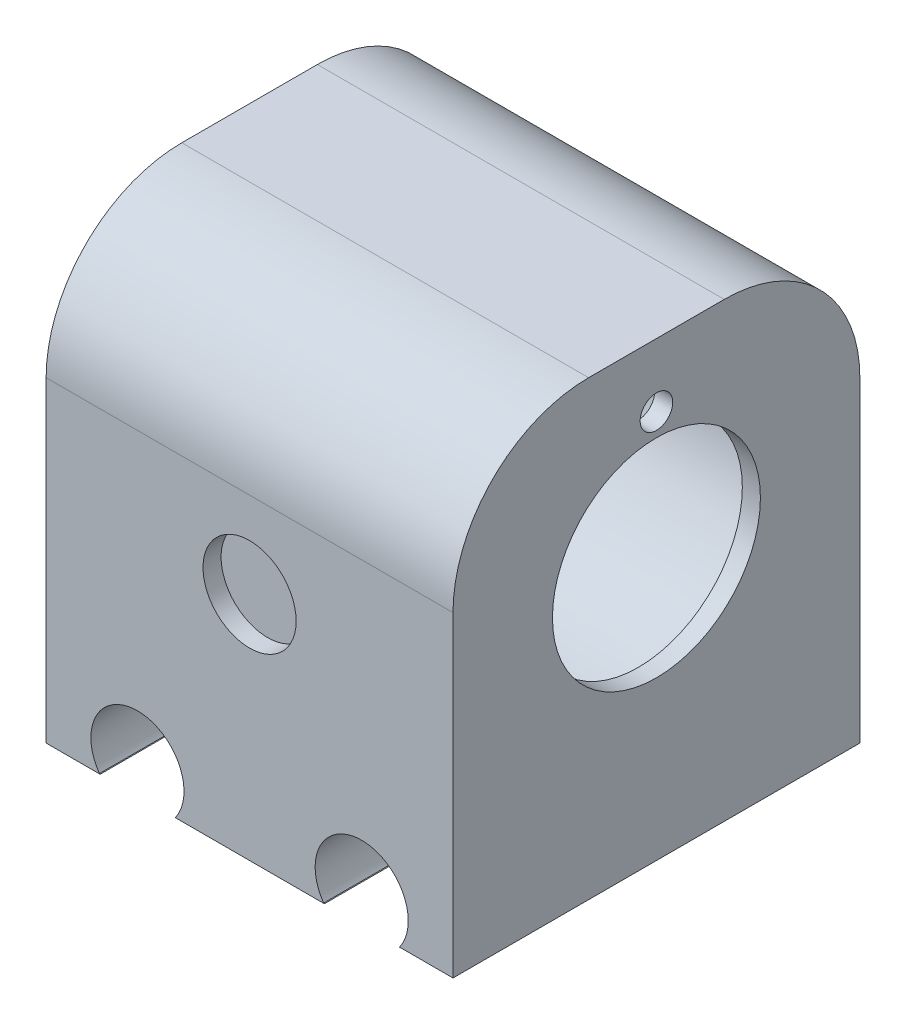
ISO-10303-21;
HEADER;
FILE_DESCRIPTION(('STEP AP214'),'2;1');
FILE_NAME('part.step','',(''),(''),'','','');
FILE_SCHEMA(('AUTOMOTIVE_DESIGN { 1 0 10303 214 1 1 1 1 }'));
ENDSEC;
DATA;
#1=APPLICATION_CONTEXT('core data for automotive mechanical design processes');
#2=APPLICATION_PROTOCOL_DEFINITION('international standard','automotive_design',2000,#1);
#3=PRODUCT_CONTEXT('',#1,'mechanical');
#4=PRODUCT('Part','Part','',(#3));
#5=PRODUCT_RELATED_PRODUCT_CATEGORY('part','',(#4));
#6=PRODUCT_DEFINITION_FORMATION('','',#4);
#7=PRODUCT_DEFINITION_CONTEXT('part definition',#1,'design');
#8=PRODUCT_DEFINITION('design','',#6,#7);
#9=PRODUCT_DEFINITION_SHAPE('','',#8);
#10=(LENGTH_UNIT() NAMED_UNIT(*) SI_UNIT(.MILLI.,.METRE.));
#11=(NAMED_UNIT(*) PLANE_ANGLE_UNIT() SI_UNIT($,.RADIAN.));
#12=(NAMED_UNIT(*) SI_UNIT($,.STERADIAN.) SOLID_ANGLE_UNIT());
#13=UNCERTAINTY_MEASURE_WITH_UNIT(LENGTH_MEASURE(1.E-05),#10,'distance_accuracy_value','');
#14=(GEOMETRIC_REPRESENTATION_CONTEXT(3) GLOBAL_UNCERTAINTY_ASSIGNED_CONTEXT((#13)) GLOBAL_UNIT_ASSIGNED_CONTEXT((#10,
#11,#12)) REPRESENTATION_CONTEXT('',''));
#15=CARTESIAN_POINT('',(0.,0.,0.));
#16=DIRECTION('',(0.,0.,1.));
#17=DIRECTION('',(1.,0.,0.));
#18=AXIS2_PLACEMENT_3D('',#15,#16,#17);
#19=CARTESIAN_POINT('',(30.7366071428572,1.09821428571429,22.5));
#20=DIRECTION('',(-1.,0.,0.));
#21=DIRECTION('',(0.,-1.,0.));
#22=AXIS2_PLACEMENT_3D('',#19,#20,#21);
#23=CYLINDRICAL_SURFACE('',#22,18.375);
#24=CARTESIAN_POINT('',(-14.2633928571429,1.09821428571429,22.5));
#25=DIRECTION('',(-1.,0.,0.));
#26=DIRECTION('',(0.,-1.,0.));
#27=AXIS2_PLACEMENT_3D('',#24,#25,#26);
#28=CIRCLE('',#27,18.375);
#29=CARTESIAN_POINT('',(-14.2633928571429,-17.2767857142857,22.5));
#30=VERTEX_POINT('',#29);
#31=EDGE_CURVE('E228',#30,#30,#28,.T.);
#32=ORIENTED_EDGE('',*,*,#31,.T.);
#33=EDGE_LOOP('',(#32));
#34=FACE_BOUND('',#33,.T.);
#35=CARTESIAN_POINT('',(28.7366071428571,1.09821428571429,22.5));
#36=DIRECTION('',(1.,0.,0.));
#37=DIRECTION('',(0.,1.,0.));
#38=AXIS2_PLACEMENT_3D('',#35,#36,#37);
#39=CIRCLE('',#38,18.375);
#40=CARTESIAN_POINT('',(28.7366071428571,19.4732142857143,22.5));
#41=VERTEX_POINT('',#40);
#42=EDGE_CURVE('E11',#41,#41,#39,.F.);
#43=ORIENTED_EDGE('',*,*,#42,.F.);
#44=EDGE_LOOP('',(#43));
#45=FACE_BOUND('',#44,.T.);
#46=ADVANCED_FACE('F39',(#34,#45),#23,.F.);
#47=CARTESIAN_POINT('',(-14.2633928571429,-27.9017857142857,45.));
#48=DIRECTION('',(0.,1.,0.));
#49=DIRECTION('',(0.,0.,1.));
#50=AXIS2_PLACEMENT_3D('',#47,#48,#49);
#51=PLANE('',#50);
#52=DIRECTION('',(1.,0.,0.));
#53=VECTOR('',#52,1.);
#54=CARTESIAN_POINT('',(-14.2633928571429,-27.9017857142857,0.));
#55=LINE('',#54,#53);
#56=CARTESIAN_POINT('',(-14.2633928571429,-27.9017857142857,0.));
#57=VERTEX_POINT('',#56);
#58=CARTESIAN_POINT('',(-8.28683282445642,-27.9017857142857,0.));
#59=VERTEX_POINT('',#58);
#60=EDGE_CURVE('E252',#57,#59,#55,.T.);
#61=ORIENTED_EDGE('',*,*,#60,.T.);
#62=DIRECTION('',(0.,0.,1.));
#63=VECTOR('',#62,1.);
#64=CARTESIAN_POINT('',(-8.28683282445642,-27.9017857142857,0.));
#65=LINE('',#64,#63);
#66=CARTESIAN_POINT('',(-8.28683282445642,-27.9017857142857,45.));
#67=VERTEX_POINT('',#66);
#68=EDGE_CURVE('E196',#59,#67,#65,.T.);
#69=ORIENTED_EDGE('',*,*,#68,.T.);
#70=DIRECTION('',(1.,0.,0.));
#71=VECTOR('',#70,1.);
#72=CARTESIAN_POINT('',(-14.2633928571429,-27.9017857142857,45.));
#73=LINE('',#72,#71);
#74=CARTESIAN_POINT('',(-14.2633928571429,-27.9017857142857,45.));
#75=VERTEX_POINT('',#74);
#76=EDGE_CURVE('E156',#75,#67,#73,.T.);
#77=ORIENTED_EDGE('',*,*,#76,.F.);
#78=DIRECTION('',(0.,0.,-1.));
#79=VECTOR('',#78,1.);
#80=CARTESIAN_POINT('',(-14.2633928571429,-27.9017857142857,45.));
#81=LINE('',#80,#79);
#82=EDGE_CURVE('E257',#75,#57,#81,.T.);
#83=ORIENTED_EDGE('',*,*,#82,.T.);
#84=EDGE_LOOP('',(#61,#69,#77,#83));
#85=FACE_BOUND('',#84,.T.);
#86=ADVANCED_FACE('F296',(#85),#51,.F.);
#87=CARTESIAN_POINT('',(0.0227446499609612,-27.9017857142857,45.));
#88=VERTEX_POINT('',#87);
#89=CARTESIAN_POINT('',(16.5166245466463,-27.9017857142857,45.));
#90=VERTEX_POINT('',#89);
#91=EDGE_CURVE('E153',#88,#90,#73,.T.);
#92=ORIENTED_EDGE('',*,*,#91,.F.);
#93=DIRECTION('',(0.,0.,1.));
#94=VECTOR('',#93,1.);
#95=CARTESIAN_POINT('',(0.0227446499609612,-27.9017857142857,0.));
#96=LINE('',#95,#94);
#97=CARTESIAN_POINT('',(0.0227446499609612,-27.9017857142857,0.));
#98=VERTEX_POINT('',#97);
#99=EDGE_CURVE('E204',#98,#88,#96,.T.);
#100=ORIENTED_EDGE('',*,*,#99,.F.);
#101=CARTESIAN_POINT('',(16.5166245466463,-27.9017857142857,0.));
#102=VERTEX_POINT('',#101);
#103=EDGE_CURVE('E254',#98,#102,#55,.T.);
#104=ORIENTED_EDGE('',*,*,#103,.T.);
#105=DIRECTION('',(0.,0.,1.));
#106=VECTOR('',#105,1.);
#107=CARTESIAN_POINT('',(16.5166245466463,-27.9017857142857,0.));
#108=LINE('',#107,#106);
#109=EDGE_CURVE('E183',#102,#90,#108,.T.);
#110=ORIENTED_EDGE('',*,*,#109,.T.);
#111=EDGE_LOOP('',(#92,#100,#104,#110));
#112=FACE_BOUND('',#111,.T.);
#113=ADVANCED_FACE('F312',(#112),#51,.F.);
#114=CARTESIAN_POINT('',(-14.2633928571429,22.0982142857143,45.));
#115=DIRECTION('',(1.,0.,0.));
#116=DIRECTION('',(0.,1.,0.));
#117=AXIS2_PLACEMENT_3D('',#114,#115,#116);
#118=PLANE('',#117);
#119=ORIENTED_EDGE('',*,*,#31,.F.);
#120=EDGE_LOOP('',(#119));
#121=FACE_BOUND('',#120,.T.);
#122=DIRECTION('',(0.,-1.,0.));
#123=VECTOR('',#122,1.);
#124=CARTESIAN_POINT('',(-14.2633928571429,22.0982142857143,45.));
#125=LINE('',#124,#123);
#126=CARTESIAN_POINT('',(-14.2633928571429,7.09821428571429,45.));
#127=VERTEX_POINT('',#126);
#128=EDGE_CURVE('E154',#127,#75,#125,.T.);
#129=ORIENTED_EDGE('',*,*,#128,.F.);
#130=CARTESIAN_POINT('',(-14.2633928571429,7.09821428571429,30.));
#131=DIRECTION('',(1.,0.,0.));
#132=DIRECTION('',(0.,1.,0.));
#133=AXIS2_PLACEMENT_3D('',#130,#131,#132);
#134=CIRCLE('',#133,15.);
#135=CARTESIAN_POINT('',(-14.2633928571429,22.0982142857143,30.));
#136=VERTEX_POINT('',#135);
#137=EDGE_CURVE('E265',#127,#136,#134,.F.);
#138=ORIENTED_EDGE('',*,*,#137,.T.);
#139=DIRECTION('',(0.,0.,-1.));
#140=VECTOR('',#139,1.);
#141=CARTESIAN_POINT('',(-14.2633928571429,22.0982142857143,0.));
#142=LINE('',#141,#140);
#143=CARTESIAN_POINT('',(-14.2633928571429,22.0982142857143,15.));
#144=VERTEX_POINT('',#143);
#145=EDGE_CURVE('E223',#136,#144,#142,.T.);
#146=ORIENTED_EDGE('',*,*,#145,.T.);
#147=CARTESIAN_POINT('',(-14.2633928571429,7.09821428571429,15.));
#148=DIRECTION('',(1.,0.,0.));
#149=DIRECTION('',(0.,1.,0.));
#150=AXIS2_PLACEMENT_3D('',#147,#148,#149);
#151=CIRCLE('',#150,15.);
#152=CARTESIAN_POINT('',(-14.2633928571429,7.09821428571429,0.));
#153=VERTEX_POINT('',#152);
#154=EDGE_CURVE('E263',#144,#153,#151,.F.);
#155=ORIENTED_EDGE('',*,*,#154,.T.);
#156=DIRECTION('',(0.,-1.,0.));
#157=VECTOR('',#156,1.);
#158=CARTESIAN_POINT('',(-14.2633928571429,22.0982142857143,0.));
#159=LINE('',#158,#157);
#160=EDGE_CURVE('E243',#153,#57,#159,.T.);
#161=ORIENTED_EDGE('',*,*,#160,.T.);
#162=ORIENTED_EDGE('',*,*,#82,.F.);
#163=EDGE_LOOP('',(#129,#138,#146,#155,#161,#162));
#164=FACE_BOUND('',#163,.T.);
#165=ADVANCED_FACE('F283',(#121,#164),#118,.F.);
#166=CARTESIAN_POINT('',(24.8227446499609,-27.9017857142857,45.));
#167=VERTEX_POINT('',#166);
#168=CARTESIAN_POINT('',(30.7366071428571,-27.9017857142857,45.));
#169=VERTEX_POINT('',#168);
#170=EDGE_CURVE('E142',#167,#169,#73,.T.);
#171=ORIENTED_EDGE('',*,*,#170,.F.);
#172=DIRECTION('',(0.,0.,1.));
#173=VECTOR('',#172,1.);
#174=CARTESIAN_POINT('',(24.8227446499609,-27.9017857142857,0.));
#175=LINE('',#174,#173);
#176=CARTESIAN_POINT('',(24.8227446499609,-27.9017857142857,0.));
#177=VERTEX_POINT('',#176);
#178=EDGE_CURVE('E145',#177,#167,#175,.T.);
#179=ORIENTED_EDGE('',*,*,#178,.F.);
#180=CARTESIAN_POINT('',(30.7366071428571,-27.9017857142857,0.));
#181=VERTEX_POINT('',#180);
#182=EDGE_CURVE('E251',#177,#181,#55,.T.);
#183=ORIENTED_EDGE('',*,*,#182,.T.);
#184=DIRECTION('',(0.,0.,-1.));
#185=VECTOR('',#184,1.);
#186=CARTESIAN_POINT('',(30.7366071428571,-27.9017857142857,45.));
#187=LINE('',#186,#185);
#188=EDGE_CURVE('E148',#169,#181,#187,.T.);
#189=ORIENTED_EDGE('',*,*,#188,.F.);
#190=EDGE_LOOP('',(#171,#179,#183,#189));
#191=FACE_BOUND('',#190,.T.);
#192=ADVANCED_FACE('F144',(#191),#51,.F.);
#193=CARTESIAN_POINT('',(30.7366071428571,22.0982142857143,45.));
#194=DIRECTION('',(-1.,0.,0.));
#195=DIRECTION('',(0.,-1.,0.));
#196=AXIS2_PLACEMENT_3D('',#193,#194,#195);
#197=PLANE('',#196);
#198=CARTESIAN_POINT('',(30.7366071428571,15.0982142857143,22.5));
#199=DIRECTION('',(1.,0.,0.));
#200=DIRECTION('',(0.,1.,0.));
#201=AXIS2_PLACEMENT_3D('',#198,#199,#200);
#202=CIRCLE('',#201,1.8);
#203=CARTESIAN_POINT('',(30.7366071428571,16.8982142857143,22.5));
#204=VERTEX_POINT('',#203);
#205=EDGE_CURVE('E207',#204,#204,#202,.T.);
#206=ORIENTED_EDGE('',*,*,#205,.F.);
#207=EDGE_LOOP('',(#206));
#208=FACE_BOUND('',#207,.T.);
#209=CARTESIAN_POINT('',(30.7366071428571,1.09821428571429,22.5));
#210=DIRECTION('',(1.,0.,0.));
#211=DIRECTION('',(0.,1.,0.));
#212=AXIS2_PLACEMENT_3D('',#209,#210,#211);
#213=CIRCLE('',#212,11.5);
#214=CARTESIAN_POINT('',(30.7366071428571,12.5982142857143,22.5));
#215=VERTEX_POINT('',#214);
#216=EDGE_CURVE('E217',#215,#215,#213,.T.);
#217=ORIENTED_EDGE('',*,*,#216,.F.);
#218=EDGE_LOOP('',(#217));
#219=FACE_BOUND('',#218,.T.);
#220=DIRECTION('',(0.,0.,-1.));
#221=VECTOR('',#220,1.);
#222=CARTESIAN_POINT('',(30.7366071428571,22.0982142857143,0.));
#223=LINE('',#222,#221);
#224=CARTESIAN_POINT('',(30.7366071428571,22.0982142857143,30.));
#225=VERTEX_POINT('',#224);
#226=CARTESIAN_POINT('',(30.7366071428571,22.0982142857143,15.));
#227=VERTEX_POINT('',#226);
#228=EDGE_CURVE('E226',#225,#227,#223,.T.);
#229=ORIENTED_EDGE('',*,*,#228,.F.);
#230=CARTESIAN_POINT('',(30.7366071428571,7.0982142857143,30.));
#231=DIRECTION('',(-1.,0.,0.));
#232=DIRECTION('',(0.,-1.,0.));
#233=AXIS2_PLACEMENT_3D('',#230,#231,#232);
#234=CIRCLE('',#233,15.);
#235=CARTESIAN_POINT('',(30.7366071428571,7.09821428571429,45.));
#236=VERTEX_POINT('',#235);
#237=EDGE_CURVE('E273',#225,#236,#234,.F.);
#238=ORIENTED_EDGE('',*,*,#237,.T.);
#239=DIRECTION('',(0.,1.,0.));
#240=VECTOR('',#239,1.);
#241=CARTESIAN_POINT('',(30.7366071428571,22.0982142857143,45.));
#242=LINE('',#241,#240);
#243=EDGE_CURVE('E248',#169,#236,#242,.T.);
#244=ORIENTED_EDGE('',*,*,#243,.F.);
#245=ORIENTED_EDGE('',*,*,#188,.T.);
#246=DIRECTION('',(0.,1.,0.));
#247=VECTOR('',#246,1.);
#248=CARTESIAN_POINT('',(30.7366071428571,22.0982142857143,0.));
#249=LINE('',#248,#247);
#250=CARTESIAN_POINT('',(30.7366071428571,7.0982142857143,0.));
#251=VERTEX_POINT('',#250);
#252=EDGE_CURVE('E246',#181,#251,#249,.T.);
#253=ORIENTED_EDGE('',*,*,#252,.T.);
#254=CARTESIAN_POINT('',(30.7366071428571,7.0982142857143,15.));
#255=DIRECTION('',(-1.,0.,0.));
#256=DIRECTION('',(0.,-1.,0.));
#257=AXIS2_PLACEMENT_3D('',#254,#255,#256);
#258=CIRCLE('',#257,15.);
#259=EDGE_CURVE('E60',#251,#227,#258,.F.);
#260=ORIENTED_EDGE('',*,*,#259,.T.);
#261=EDGE_LOOP('',(#229,#238,#244,#245,#253,#260));
#262=FACE_BOUND('',#261,.T.);
#263=ADVANCED_FACE('F275',(#208,#219,#262),#197,.F.);
#264=CARTESIAN_POINT('',(0.,0.,45.));
#265=DIRECTION('',(0.,0.,1.));
#266=DIRECTION('',(1.,0.,0.));
#267=AXIS2_PLACEMENT_3D('',#264,#265,#266);
#268=PLANE('',#267);
#269=ORIENTED_EDGE('',*,*,#243,.T.);
#270=DIRECTION('',(-1.,0.,0.));
#271=VECTOR('',#270,1.);
#272=CARTESIAN_POINT('',(0.,7.09821428571429,45.));
#273=LINE('',#272,#271);
#274=EDGE_CURVE('E260',#236,#127,#273,.T.);
#275=ORIENTED_EDGE('',*,*,#274,.T.);
#276=ORIENTED_EDGE('',*,*,#128,.T.);
#277=ORIENTED_EDGE('',*,*,#76,.T.);
#278=DIRECTION('',(-0.94466791578687,0.328028244032264,0.));
#279=VECTOR('',#278,1.);
#280=CARTESIAN_POINT('',(-8.36990504926654,-27.8729395604396,45.));
#281=LINE('',#280,#279);
#282=CARTESIAN_POINT('',(-8.36990504926654,-27.8729395604396,45.));
#283=VERTEX_POINT('',#282);
#284=EDGE_CURVE('E181',#67,#283,#281,.T.);
#285=ORIENTED_EDGE('',*,*,#284,.T.);
#286=CARTESIAN_POINT('',(-4.16339285714286,-24.9017857142857,45.));
#287=DIRECTION('',(0.,0.,-1.));
#288=DIRECTION('',(1.,0.,0.));
#289=AXIS2_PLACEMENT_3D('',#286,#287,#288);
#290=CIRCLE('',#289,5.15);
#291=CARTESIAN_POINT('',(0.0431193349808264,-27.8729395604396,45.));
#292=VERTEX_POINT('',#291);
#293=EDGE_CURVE('E199',#283,#292,#290,.T.);
#294=ORIENTED_EDGE('',*,*,#293,.T.);
#295=DIRECTION('',(-0.576923076923066,-0.816798483907519,0.));
#296=VECTOR('',#295,1.);
#297=CARTESIAN_POINT('',(0.0431193349808264,-27.8729395604396,45.));
#298=LINE('',#297,#296);
#299=EDGE_CURVE('E190',#292,#88,#298,.T.);
#300=ORIENTED_EDGE('',*,*,#299,.T.);
#301=ORIENTED_EDGE('',*,*,#91,.T.);
#302=DIRECTION('',(-0.948673577708609,0.316256925548752,0.));
#303=VECTOR('',#302,1.);
#304=CARTESIAN_POINT('',(16.4300949507335,-27.8729395604396,45.));
#305=LINE('',#304,#303);
#306=CARTESIAN_POINT('',(16.4300949507335,-27.8729395604396,45.));
#307=VERTEX_POINT('',#306);
#308=EDGE_CURVE('E173',#90,#307,#305,.T.);
#309=ORIENTED_EDGE('',*,*,#308,.T.);
#310=CARTESIAN_POINT('',(20.6366071428571,-24.9017857142857,45.));
#311=DIRECTION('',(0.,0.,-1.));
#312=DIRECTION('',(1.,0.,0.));
#313=AXIS2_PLACEMENT_3D('',#310,#311,#312);
#314=CIRCLE('',#313,5.15);
#315=CARTESIAN_POINT('',(24.8431193349808,-27.8729395604396,45.));
#316=VERTEX_POINT('',#315);
#317=EDGE_CURVE('E170',#307,#316,#314,.T.);
#318=ORIENTED_EDGE('',*,*,#317,.T.);
#319=DIRECTION('',(-0.576923076923173,-0.816798483907444,0.));
#320=VECTOR('',#319,1.);
#321=CARTESIAN_POINT('',(24.8431193349808,-27.8729395604396,45.));
#322=LINE('',#321,#320);
#323=EDGE_CURVE('E160',#316,#167,#322,.T.);
#324=ORIENTED_EDGE('',*,*,#323,.T.);
#325=ORIENTED_EDGE('',*,*,#170,.T.);
#326=EDGE_LOOP('',(#269,#275,#276,#277,#285,#294,#300,#301,#309,#318,#324,#325));
#327=FACE_BOUND('',#326,.T.);
#328=CARTESIAN_POINT('',(8.23660714285715,-2.40178571428571,45.));
#329=DIRECTION('',(0.,0.,1.));
#330=DIRECTION('',(1.,0.,0.));
#331=AXIS2_PLACEMENT_3D('',#328,#329,#330);
#332=CIRCLE('',#331,5.15);
#333=CARTESIAN_POINT('',(13.3866071428572,-2.40178571428571,45.));
#334=VERTEX_POINT('',#333);
#335=EDGE_CURVE('E237',#334,#334,#332,.T.);
#336=ORIENTED_EDGE('',*,*,#335,.F.);
#337=EDGE_LOOP('',(#336));
#338=FACE_BOUND('',#337,.T.);
#339=ADVANCED_FACE('F166',(#327,#338),#268,.T.);
#340=CARTESIAN_POINT('',(0.,0.,0.));
#341=DIRECTION('',(0.,0.,1.));
#342=DIRECTION('',(1.,0.,0.));
#343=AXIS2_PLACEMENT_3D('',#340,#341,#342);
#344=PLANE('',#343);
#345=CARTESIAN_POINT('',(8.23660714285714,-2.40178571428571,0.));
#346=DIRECTION('',(0.,0.,-1.));
#347=DIRECTION('',(-1.,0.,0.));
#348=AXIS2_PLACEMENT_3D('',#345,#346,#347);
#349=CIRCLE('',#348,5.15);
#350=CARTESIAN_POINT('',(3.08660714285714,-2.40178571428571,0.));
#351=VERTEX_POINT('',#350);
#352=EDGE_CURVE('E233',#351,#351,#349,.T.);
#353=ORIENTED_EDGE('',*,*,#352,.F.);
#354=EDGE_LOOP('',(#353));
#355=FACE_BOUND('',#354,.T.);
#356=ORIENTED_EDGE('',*,*,#160,.F.);
#357=DIRECTION('',(-1.,0.,0.));
#358=VECTOR('',#357,1.);
#359=CARTESIAN_POINT('',(30.7366071428571,7.0982142857143,0.));
#360=LINE('',#359,#358);
#361=EDGE_CURVE('E47',#153,#251,#360,.F.);
#362=ORIENTED_EDGE('',*,*,#361,.T.);
#363=ORIENTED_EDGE('',*,*,#252,.F.);
#364=ORIENTED_EDGE('',*,*,#182,.F.);
#365=DIRECTION('',(-0.576923076923173,-0.816798483907444,0.));
#366=VECTOR('',#365,1.);
#367=CARTESIAN_POINT('',(24.8431193349808,-27.8729395604396,0.));
#368=LINE('',#367,#366);
#369=CARTESIAN_POINT('',(24.8431193349808,-27.8729395604396,0.));
#370=VERTEX_POINT('',#369);
#371=EDGE_CURVE('E163',#370,#177,#368,.T.);
#372=ORIENTED_EDGE('',*,*,#371,.F.);
#373=CARTESIAN_POINT('',(20.6366071428571,-24.9017857142857,0.));
#374=DIRECTION('',(0.,0.,-1.));
#375=DIRECTION('',(1.,0.,0.));
#376=AXIS2_PLACEMENT_3D('',#373,#374,#375);
#377=CIRCLE('',#376,5.15);
#378=CARTESIAN_POINT('',(16.4300949507335,-27.8729395604396,0.));
#379=VERTEX_POINT('',#378);
#380=EDGE_CURVE('E176',#379,#370,#377,.T.);
#381=ORIENTED_EDGE('',*,*,#380,.F.);
#382=DIRECTION('',(-0.948673577708609,0.316256925548752,0.));
#383=VECTOR('',#382,1.);
#384=CARTESIAN_POINT('',(16.4300949507335,-27.8729395604396,0.));
#385=LINE('',#384,#383);
#386=EDGE_CURVE('E171',#102,#379,#385,.T.);
#387=ORIENTED_EDGE('',*,*,#386,.F.);
#388=ORIENTED_EDGE('',*,*,#103,.F.);
#389=DIRECTION('',(-0.576923076923066,-0.816798483907519,0.));
#390=VECTOR('',#389,1.);
#391=CARTESIAN_POINT('',(0.0431193349808264,-27.8729395604396,0.));
#392=LINE('',#391,#390);
#393=CARTESIAN_POINT('',(0.0431193349808264,-27.8729395604396,0.));
#394=VERTEX_POINT('',#393);
#395=EDGE_CURVE('E193',#394,#98,#392,.T.);
#396=ORIENTED_EDGE('',*,*,#395,.F.);
#397=CARTESIAN_POINT('',(-4.16339285714286,-24.9017857142857,0.));
#398=DIRECTION('',(0.,0.,-1.));
#399=DIRECTION('',(1.,0.,0.));
#400=AXIS2_PLACEMENT_3D('',#397,#398,#399);
#401=CIRCLE('',#400,5.15);
#402=CARTESIAN_POINT('',(-8.36990504926654,-27.8729395604396,0.));
#403=VERTEX_POINT('',#402);
#404=EDGE_CURVE('E189',#403,#394,#401,.T.);
#405=ORIENTED_EDGE('',*,*,#404,.F.);
#406=DIRECTION('',(-0.94466791578687,0.328028244032264,0.));
#407=VECTOR('',#406,1.);
#408=CARTESIAN_POINT('',(-8.36990504926654,-27.8729395604396,0.));
#409=LINE('',#408,#407);
#410=EDGE_CURVE('E186',#59,#403,#409,.T.);
#411=ORIENTED_EDGE('',*,*,#410,.F.);
#412=ORIENTED_EDGE('',*,*,#60,.F.);
#413=EDGE_LOOP('',(#356,#362,#363,#364,#372,#381,#387,#388,#396,#405,#411,#412));
#414=FACE_BOUND('',#413,.T.);
#415=ADVANCED_FACE('F290',(#355,#414),#344,.F.);
#416=CARTESIAN_POINT('',(8.23660714285715,-2.40178571428571,43.));
#417=DIRECTION('',(0.,0.,1.));
#418=DIRECTION('',(1.,0.,0.));
#419=AXIS2_PLACEMENT_3D('',#416,#417,#418);
#420=CYLINDRICAL_SURFACE('',#419,5.15);
#421=CARTESIAN_POINT('',(8.23660714285715,-2.40178571428571,43.));
#422=DIRECTION('',(0.,0.,1.));
#423=DIRECTION('',(1.,0.,0.));
#424=AXIS2_PLACEMENT_3D('',#421,#422,#423);
#425=CIRCLE('',#424,5.15);
#426=CARTESIAN_POINT('',(13.3866071428572,-2.40178571428571,43.));
#427=VERTEX_POINT('',#426);
#428=EDGE_CURVE('E240',#427,#427,#425,.T.);
#429=ORIENTED_EDGE('',*,*,#428,.F.);
#430=EDGE_LOOP('',(#429));
#431=FACE_BOUND('',#430,.T.);
#432=ORIENTED_EDGE('',*,*,#335,.T.);
#433=EDGE_LOOP('',(#432));
#434=FACE_BOUND('',#433,.T.);
#435=ADVANCED_FACE('F354',(#431,#434),#420,.F.);
#436=CARTESIAN_POINT('',(8.23660714285715,-2.40178571428571,43.));
#437=DIRECTION('',(0.,0.,1.));
#438=DIRECTION('',(1.,0.,0.));
#439=AXIS2_PLACEMENT_3D('',#436,#437,#438);
#440=PLANE('',#439);
#441=ORIENTED_EDGE('',*,*,#428,.T.);
#442=EDGE_LOOP('',(#441));
#443=FACE_BOUND('',#442,.T.);
#444=ADVANCED_FACE('F350',(#443),#440,.T.);
#445=CARTESIAN_POINT('',(8.23660714285714,-2.40178571428571,2.));
#446=DIRECTION('',(0.,0.,-1.));
#447=DIRECTION('',(-1.,0.,0.));
#448=AXIS2_PLACEMENT_3D('',#445,#446,#447);
#449=CYLINDRICAL_SURFACE('',#448,5.15);
#450=CARTESIAN_POINT('',(8.23660714285714,-2.40178571428571,2.));
#451=DIRECTION('',(0.,0.,-1.));
#452=DIRECTION('',(-1.,0.,0.));
#453=AXIS2_PLACEMENT_3D('',#450,#451,#452);
#454=CIRCLE('',#453,5.15);
#455=CARTESIAN_POINT('',(3.08660714285714,-2.40178571428571,2.));
#456=VERTEX_POINT('',#455);
#457=EDGE_CURVE('E234',#456,#456,#454,.T.);
#458=ORIENTED_EDGE('',*,*,#457,.F.);
#459=EDGE_LOOP('',(#458));
#460=FACE_BOUND('',#459,.T.);
#461=ORIENTED_EDGE('',*,*,#352,.T.);
#462=EDGE_LOOP('',(#461));
#463=FACE_BOUND('',#462,.T.);
#464=ADVANCED_FACE('F346',(#460,#463),#449,.F.);
#465=CARTESIAN_POINT('',(8.23660714285714,-2.40178571428571,2.));
#466=DIRECTION('',(0.,0.,-1.));
#467=DIRECTION('',(-1.,0.,0.));
#468=AXIS2_PLACEMENT_3D('',#465,#466,#467);
#469=PLANE('',#468);
#470=ORIENTED_EDGE('',*,*,#457,.T.);
#471=EDGE_LOOP('',(#470));
#472=FACE_BOUND('',#471,.T.);
#473=ADVANCED_FACE('F343',(#472),#469,.T.);
#474=CARTESIAN_POINT('',(30.7366071428571,22.0982142857143,0.));
#475=DIRECTION('',(0.,1.,0.));
#476=DIRECTION('',(-1.,0.,0.));
#477=AXIS2_PLACEMENT_3D('',#474,#475,#476);
#478=PLANE('',#477);
#479=ORIENTED_EDGE('',*,*,#145,.F.);
#480=DIRECTION('',(-1.,0.,0.));
#481=VECTOR('',#480,1.);
#482=CARTESIAN_POINT('',(30.7366071428571,22.0982142857143,30.));
#483=LINE('',#482,#481);
#484=EDGE_CURVE('E270',#136,#225,#483,.F.);
#485=ORIENTED_EDGE('',*,*,#484,.T.);
#486=ORIENTED_EDGE('',*,*,#228,.T.);
#487=DIRECTION('',(-1.,0.,0.));
#488=VECTOR('',#487,1.);
#489=CARTESIAN_POINT('',(-14.2633928571429,22.0982142857143,15.));
#490=LINE('',#489,#488);
#491=EDGE_CURVE('E267',#227,#144,#490,.T.);
#492=ORIENTED_EDGE('',*,*,#491,.T.);
#493=EDGE_LOOP('',(#479,#485,#486,#492));
#494=FACE_BOUND('',#493,.T.);
#495=ADVANCED_FACE('F286',(#494),#478,.T.);
#496=CARTESIAN_POINT('',(0.,7.09821428571429,30.));
#497=DIRECTION('',(-1.,0.,0.));
#498=DIRECTION('',(0.,-1.,0.));
#499=AXIS2_PLACEMENT_3D('',#496,#497,#498);
#500=CYLINDRICAL_SURFACE('',#499,15.);
#501=ORIENTED_EDGE('',*,*,#237,.F.);
#502=ORIENTED_EDGE('',*,*,#484,.F.);
#503=ORIENTED_EDGE('',*,*,#137,.F.);
#504=ORIENTED_EDGE('',*,*,#274,.F.);
#505=EDGE_LOOP('',(#501,#502,#503,#504));
#506=FACE_BOUND('',#505,.T.);
#507=ADVANCED_FACE('F280',(#506),#500,.T.);
#508=CARTESIAN_POINT('',(30.7366071428571,7.0982142857143,15.));
#509=DIRECTION('',(1.,0.,0.));
#510=DIRECTION('',(0.,1.,0.));
#511=AXIS2_PLACEMENT_3D('',#508,#509,#510);
#512=CYLINDRICAL_SURFACE('',#511,15.);
#513=ORIENTED_EDGE('',*,*,#259,.F.);
#514=ORIENTED_EDGE('',*,*,#361,.F.);
#515=ORIENTED_EDGE('',*,*,#154,.F.);
#516=ORIENTED_EDGE('',*,*,#491,.F.);
#517=EDGE_LOOP('',(#513,#514,#515,#516));
#518=FACE_BOUND('',#517,.T.);
#519=ADVANCED_FACE('F41',(#518),#512,.T.);
#520=CARTESIAN_POINT('',(28.7366071428571,1.09821428571429,22.5));
#521=DIRECTION('',(1.,0.,0.));
#522=DIRECTION('',(0.,1.,0.));
#523=AXIS2_PLACEMENT_3D('',#520,#521,#522);
#524=PLANE('',#523);
#525=CARTESIAN_POINT('',(28.7366071428571,15.0982142857143,22.5));
#526=DIRECTION('',(1.,0.,0.));
#527=DIRECTION('',(0.,1.,0.));
#528=AXIS2_PLACEMENT_3D('',#525,#526,#527);
#529=CIRCLE('',#528,1.8);
#530=CARTESIAN_POINT('',(28.7366071428571,16.8982142857143,22.5));
#531=VERTEX_POINT('',#530);
#532=EDGE_CURVE('E214',#531,#531,#529,.T.);
#533=ORIENTED_EDGE('',*,*,#532,.T.);
#534=EDGE_LOOP('',(#533));
#535=FACE_BOUND('',#534,.T.);
#536=CARTESIAN_POINT('',(28.7366071428571,1.09821428571429,22.5));
#537=DIRECTION('',(1.,0.,0.));
#538=DIRECTION('',(0.,1.,0.));
#539=AXIS2_PLACEMENT_3D('',#536,#537,#538);
#540=CIRCLE('',#539,11.5);
#541=CARTESIAN_POINT('',(28.7366071428571,12.5982142857143,22.5));
#542=VERTEX_POINT('',#541);
#543=EDGE_CURVE('E220',#542,#542,#540,.T.);
#544=ORIENTED_EDGE('',*,*,#543,.T.);
#545=EDGE_LOOP('',(#544));
#546=FACE_BOUND('',#545,.T.);
#547=ORIENTED_EDGE('',*,*,#42,.T.);
#548=EDGE_LOOP('',(#547));
#549=FACE_BOUND('',#548,.T.);
#550=ADVANCED_FACE('F374',(#535,#546,#549),#524,.F.);
#551=CARTESIAN_POINT('',(28.7366071428571,1.09821428571429,22.5));
#552=DIRECTION('',(1.,0.,0.));
#553=DIRECTION('',(0.,1.,0.));
#554=AXIS2_PLACEMENT_3D('',#551,#552,#553);
#555=CYLINDRICAL_SURFACE('',#554,11.5);
#556=ORIENTED_EDGE('',*,*,#543,.F.);
#557=EDGE_LOOP('',(#556));
#558=FACE_BOUND('',#557,.T.);
#559=ORIENTED_EDGE('',*,*,#216,.T.);
#560=EDGE_LOOP('',(#559));
#561=FACE_BOUND('',#560,.T.);
#562=ADVANCED_FACE('F522',(#558,#561),#555,.F.);
#563=CARTESIAN_POINT('',(28.7366071428571,15.0982142857143,22.5));
#564=DIRECTION('',(1.,0.,0.));
#565=DIRECTION('',(0.,1.,0.));
#566=AXIS2_PLACEMENT_3D('',#563,#564,#565);
#567=CYLINDRICAL_SURFACE('',#566,1.8);
#568=ORIENTED_EDGE('',*,*,#532,.F.);
#569=EDGE_LOOP('',(#568));
#570=FACE_BOUND('',#569,.T.);
#571=ORIENTED_EDGE('',*,*,#205,.T.);
#572=EDGE_LOOP('',(#571));
#573=FACE_BOUND('',#572,.T.);
#574=ADVANCED_FACE('F483',(#570,#573),#567,.F.);
#575=CARTESIAN_POINT('',(0.0431193349808264,-27.8729395604396,0.));
#576=DIRECTION('',(-0.816798483907519,0.576923076923067,0.));
#577=DIRECTION('',(-0.576923076923067,-0.816798483907519,0.));
#578=AXIS2_PLACEMENT_3D('',#575,#576,#577);
#579=PLANE('',#578);
#580=ORIENTED_EDGE('',*,*,#299,.F.);
#581=DIRECTION('',(0.,0.,1.));
#582=VECTOR('',#581,1.);
#583=CARTESIAN_POINT('',(0.0431193349808264,-27.8729395604396,0.));
#584=LINE('',#583,#582);
#585=EDGE_CURVE('E208',#394,#292,#584,.T.);
#586=ORIENTED_EDGE('',*,*,#585,.F.);
#587=ORIENTED_EDGE('',*,*,#395,.T.);
#588=ORIENTED_EDGE('',*,*,#99,.T.);
#589=EDGE_LOOP('',(#580,#586,#587,#588));
#590=FACE_BOUND('',#589,.T.);
#591=ADVANCED_FACE('F306',(#590),#579,.T.);
#592=CARTESIAN_POINT('',(-4.16339285714286,-24.9017857142857,0.));
#593=DIRECTION('',(0.,0.,1.));
#594=DIRECTION('',(1.,0.,0.));
#595=AXIS2_PLACEMENT_3D('',#592,#593,#594);
#596=CYLINDRICAL_SURFACE('',#595,5.15);
#597=ORIENTED_EDGE('',*,*,#293,.F.);
#598=DIRECTION('',(0.,0.,1.));
#599=VECTOR('',#598,1.);
#600=CARTESIAN_POINT('',(-8.36990504926654,-27.8729395604396,0.));
#601=LINE('',#600,#599);
#602=EDGE_CURVE('E210',#403,#283,#601,.T.);
#603=ORIENTED_EDGE('',*,*,#602,.F.);
#604=ORIENTED_EDGE('',*,*,#404,.T.);
#605=ORIENTED_EDGE('',*,*,#585,.T.);
#606=EDGE_LOOP('',(#597,#603,#604,#605));
#607=FACE_BOUND('',#606,.T.);
#608=ADVANCED_FACE('F302',(#607),#596,.F.);
#609=CARTESIAN_POINT('',(-8.36990504926654,-27.8729395604396,0.));
#610=DIRECTION('',(0.328028244032264,0.94466791578687,0.));
#611=DIRECTION('',(-0.94466791578687,0.328028244032264,0.));
#612=AXIS2_PLACEMENT_3D('',#609,#610,#611);
#613=PLANE('',#612);
#614=ORIENTED_EDGE('',*,*,#284,.F.);
#615=ORIENTED_EDGE('',*,*,#68,.F.);
#616=ORIENTED_EDGE('',*,*,#410,.T.);
#617=ORIENTED_EDGE('',*,*,#602,.T.);
#618=EDGE_LOOP('',(#614,#615,#616,#617));
#619=FACE_BOUND('',#618,.T.);
#620=ADVANCED_FACE('F300',(#619),#613,.T.);
#621=CARTESIAN_POINT('',(24.8431193349808,-27.8729395604396,0.));
#622=DIRECTION('',(-0.816798483907444,0.576923076923173,0.));
#623=DIRECTION('',(-0.576923076923173,-0.816798483907444,0.));
#624=AXIS2_PLACEMENT_3D('',#621,#622,#623);
#625=PLANE('',#624);
#626=ORIENTED_EDGE('',*,*,#323,.F.);
#627=DIRECTION('',(0.,0.,1.));
#628=VECTOR('',#627,1.);
#629=CARTESIAN_POINT('',(24.8431193349808,-27.8729395604396,0.));
#630=LINE('',#629,#628);
#631=EDGE_CURVE('E164',#370,#316,#630,.T.);
#632=ORIENTED_EDGE('',*,*,#631,.F.);
#633=ORIENTED_EDGE('',*,*,#371,.T.);
#634=ORIENTED_EDGE('',*,*,#178,.T.);
#635=EDGE_LOOP('',(#626,#632,#633,#634));
#636=FACE_BOUND('',#635,.T.);
#637=ADVANCED_FACE('F159',(#636),#625,.T.);
#638=CARTESIAN_POINT('',(20.6366071428571,-24.9017857142857,0.));
#639=DIRECTION('',(0.,0.,1.));
#640=DIRECTION('',(1.,0.,0.));
#641=AXIS2_PLACEMENT_3D('',#638,#639,#640);
#642=CYLINDRICAL_SURFACE('',#641,5.15);
#643=ORIENTED_EDGE('',*,*,#317,.F.);
#644=DIRECTION('',(0.,0.,1.));
#645=VECTOR('',#644,1.);
#646=CARTESIAN_POINT('',(16.4300949507335,-27.8729395604396,0.));
#647=LINE('',#646,#645);
#648=EDGE_CURVE('E315',#379,#307,#647,.T.);
#649=ORIENTED_EDGE('',*,*,#648,.F.);
#650=ORIENTED_EDGE('',*,*,#380,.T.);
#651=ORIENTED_EDGE('',*,*,#631,.T.);
#652=EDGE_LOOP('',(#643,#649,#650,#651));
#653=FACE_BOUND('',#652,.T.);
#654=ADVANCED_FACE('F321',(#653),#642,.F.);
#655=CARTESIAN_POINT('',(16.4300949507335,-27.8729395604396,0.));
#656=DIRECTION('',(0.316256925548752,0.948673577708609,0.));
#657=DIRECTION('',(-0.948673577708609,0.316256925548752,0.));
#658=AXIS2_PLACEMENT_3D('',#655,#656,#657);
#659=PLANE('',#658);
#660=ORIENTED_EDGE('',*,*,#308,.F.);
#661=ORIENTED_EDGE('',*,*,#109,.F.);
#662=ORIENTED_EDGE('',*,*,#386,.T.);
#663=ORIENTED_EDGE('',*,*,#648,.T.);
#664=EDGE_LOOP('',(#660,#661,#662,#663));
#665=FACE_BOUND('',#664,.T.);
#666=ADVANCED_FACE('F317',(#665),#659,.T.);
#667=CLOSED_SHELL('',(#46,#86,#113,#165,#192,#263,#339,#415,#435,#444,#464,#473,#495,#507,#519,
#550,#562,#574,#591,#608,#620,#637,#654,#666));
#668=MANIFOLD_SOLID_BREP('B2',#667);
#669=ADVANCED_BREP_SHAPE_REPRESENTATION('',(#18,#668),#14);
#670=SHAPE_DEFINITION_REPRESENTATION(#9,#669);
ENDSEC;
END-ISO-10303-21;
